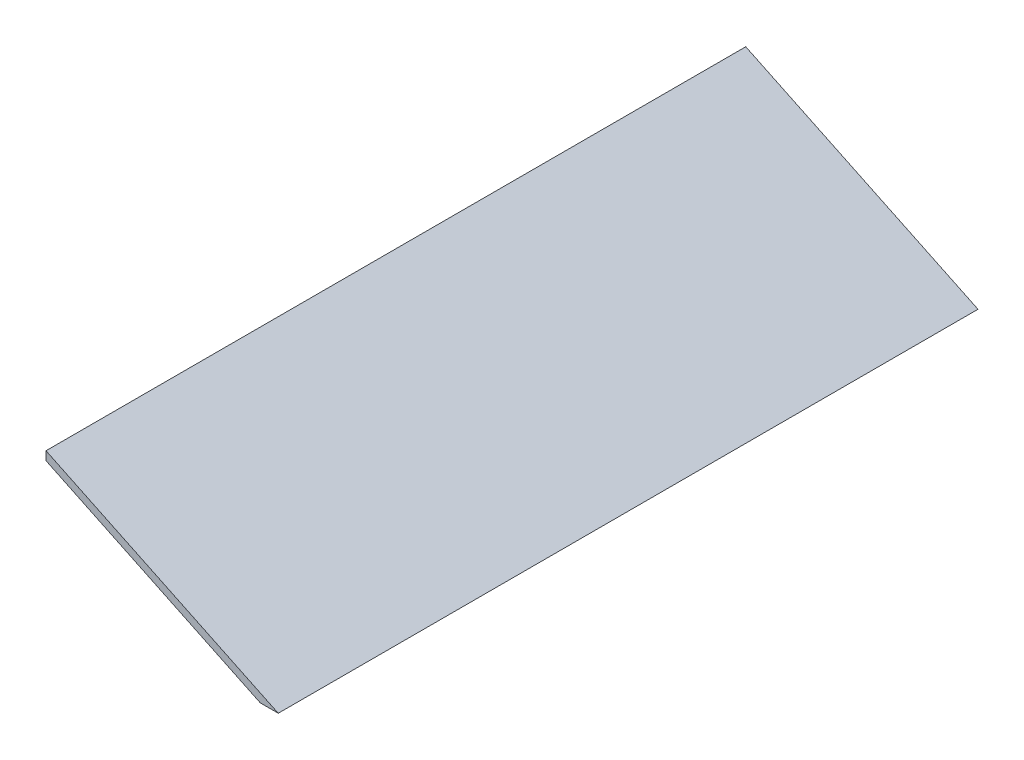
ISO-10303-21;
HEADER;
FILE_DESCRIPTION(('STEP AP214'),'2;1');
FILE_NAME('part.step','',(''),(''),'','','');
FILE_SCHEMA(('AUTOMOTIVE_DESIGN { 1 0 10303 214 1 1 1 1 }'));
ENDSEC;
DATA;
#1=APPLICATION_CONTEXT('core data for automotive mechanical design processes');
#2=APPLICATION_PROTOCOL_DEFINITION('international standard','automotive_design',2000,#1);
#3=PRODUCT_CONTEXT('',#1,'mechanical');
#4=PRODUCT('Part','Part','',(#3));
#5=PRODUCT_RELATED_PRODUCT_CATEGORY('part','',(#4));
#6=PRODUCT_DEFINITION_FORMATION('','',#4);
#7=PRODUCT_DEFINITION_CONTEXT('part definition',#1,'design');
#8=PRODUCT_DEFINITION('design','',#6,#7);
#9=PRODUCT_DEFINITION_SHAPE('','',#8);
#10=(LENGTH_UNIT() NAMED_UNIT(*) SI_UNIT(.MILLI.,.METRE.));
#11=(NAMED_UNIT(*) PLANE_ANGLE_UNIT() SI_UNIT($,.RADIAN.));
#12=(NAMED_UNIT(*) SI_UNIT($,.STERADIAN.) SOLID_ANGLE_UNIT());
#13=UNCERTAINTY_MEASURE_WITH_UNIT(LENGTH_MEASURE(1.E-05),#10,'distance_accuracy_value','');
#14=(GEOMETRIC_REPRESENTATION_CONTEXT(3) GLOBAL_UNCERTAINTY_ASSIGNED_CONTEXT((#13)) GLOBAL_UNIT_ASSIGNED_CONTEXT((#10,
#11,#12)) REPRESENTATION_CONTEXT('',''));
#15=CARTESIAN_POINT('',(0.,0.,0.));
#16=DIRECTION('',(0.,0.,1.));
#17=DIRECTION('',(1.,0.,0.));
#18=AXIS2_PLACEMENT_3D('',#15,#16,#17);
#19=CARTESIAN_POINT('',(-331.860776554524,76.5248789134339,450.));
#20=DIRECTION('',(-0.431904937574063,-0.901919134345837,0.));
#21=DIRECTION('',(0.901919134345838,-0.431904937574063,0.));
#22=AXIS2_PLACEMENT_3D('',#19,#20,#21);
#23=PLANE('',#22);
#24=DIRECTION('',(-0.901919134345837,0.431904937574063,0.));
#25=VECTOR('',#24,1.);
#26=CARTESIAN_POINT('',(-331.860776554524,76.5248789134339,0.));
#27=LINE('',#26,#25);
#28=CARTESIAN_POINT('',(-182.5,5.,0.));
#29=VERTEX_POINT('',#28);
#30=CARTESIAN_POINT('',(-331.860776554524,76.5248789134339,0.));
#31=VERTEX_POINT('',#30);
#32=EDGE_CURVE('E96',#29,#31,#27,.T.);
#33=ORIENTED_EDGE('',*,*,#32,.T.);
#34=DIRECTION('',(0.,0.,-1.));
#35=VECTOR('',#34,1.);
#36=CARTESIAN_POINT('',(-331.860776554524,76.5248789134339,450.));
#37=LINE('',#36,#35);
#38=CARTESIAN_POINT('',(-331.860776554524,76.5248789134339,450.));
#39=VERTEX_POINT('',#38);
#40=EDGE_CURVE('E11',#39,#31,#37,.T.);
#41=ORIENTED_EDGE('',*,*,#40,.F.);
#42=DIRECTION('',(-0.901919134345837,0.431904937574063,0.));
#43=VECTOR('',#42,1.);
#44=CARTESIAN_POINT('',(-331.860776554524,76.5248789134339,450.));
#45=LINE('',#44,#43);
#46=CARTESIAN_POINT('',(-182.5,5.,450.));
#47=VERTEX_POINT('',#46);
#48=EDGE_CURVE('E84',#47,#39,#45,.T.);
#49=ORIENTED_EDGE('',*,*,#48,.F.);
#50=DIRECTION('',(0.,0.,-1.));
#51=VECTOR('',#50,1.);
#52=CARTESIAN_POINT('',(-182.5,5.,450.));
#53=LINE('',#52,#51);
#54=EDGE_CURVE('E92',#47,#29,#53,.T.);
#55=ORIENTED_EDGE('',*,*,#54,.T.);
#56=EDGE_LOOP('',(#33,#41,#49,#55));
#57=FACE_BOUND('',#56,.T.);
#58=ADVANCED_FACE('F33',(#57),#23,.F.);
#59=CARTESIAN_POINT('',(-331.860776554524,76.5248789134339,450.));
#60=DIRECTION('',(1.,0.,0.));
#61=DIRECTION('',(0.,0.,-1.));
#62=AXIS2_PLACEMENT_3D('',#59,#60,#61);
#63=PLANE('',#62);
#64=DIRECTION('',(0.,-1.,0.));
#65=VECTOR('',#64,1.);
#66=CARTESIAN_POINT('',(-331.860776554524,76.5248789134339,0.));
#67=LINE('',#66,#65);
#68=CARTESIAN_POINT('',(-331.860776554524,70.9811446587809,0.));
#69=VERTEX_POINT('',#68);
#70=EDGE_CURVE('E88',#31,#69,#67,.T.);
#71=ORIENTED_EDGE('',*,*,#70,.T.);
#72=DIRECTION('',(0.,0.,-1.));
#73=VECTOR('',#72,1.);
#74=CARTESIAN_POINT('',(-331.860776554524,70.9811446587809,450.));
#75=LINE('',#74,#73);
#76=CARTESIAN_POINT('',(-331.860776554524,70.9811446587809,450.));
#77=VERTEX_POINT('',#76);
#78=EDGE_CURVE('E41',#77,#69,#75,.T.);
#79=ORIENTED_EDGE('',*,*,#78,.F.);
#80=DIRECTION('',(0.,-1.,0.));
#81=VECTOR('',#80,1.);
#82=CARTESIAN_POINT('',(-331.860776554524,76.5248789134339,450.));
#83=LINE('',#82,#81);
#84=EDGE_CURVE('E79',#39,#77,#83,.T.);
#85=ORIENTED_EDGE('',*,*,#84,.F.);
#86=ORIENTED_EDGE('',*,*,#40,.T.);
#87=EDGE_LOOP('',(#71,#79,#85,#86));
#88=FACE_BOUND('',#87,.T.);
#89=ADVANCED_FACE('F87',(#88),#63,.F.);
#90=CARTESIAN_POINT('',(-331.860776554524,70.9811446587809,450.));
#91=DIRECTION('',(0.431904937574063,0.901919134345837,0.));
#92=DIRECTION('',(-0.901919134345837,0.431904937574063,0.));
#93=AXIS2_PLACEMENT_3D('',#90,#91,#92);
#94=PLANE('',#93);
#95=DIRECTION('',(0.901919134345838,-0.431904937574063,0.));
#96=VECTOR('',#95,1.);
#97=CARTESIAN_POINT('',(-331.860776554524,70.9811446587809,0.));
#98=LINE('',#97,#96);
#99=CARTESIAN_POINT('',(-194.076621531775,5.,0.));
#100=VERTEX_POINT('',#99);
#101=EDGE_CURVE('E66',#69,#100,#98,.T.);
#102=ORIENTED_EDGE('',*,*,#101,.T.);
#103=DIRECTION('',(0.,0.,-1.));
#104=VECTOR('',#103,1.);
#105=CARTESIAN_POINT('',(-194.076621531775,5.,450.));
#106=LINE('',#105,#104);
#107=CARTESIAN_POINT('',(-194.076621531775,5.,450.));
#108=VERTEX_POINT('',#107);
#109=EDGE_CURVE('E89',#108,#100,#106,.T.);
#110=ORIENTED_EDGE('',*,*,#109,.F.);
#111=DIRECTION('',(0.901919134345838,-0.431904937574063,0.));
#112=VECTOR('',#111,1.);
#113=CARTESIAN_POINT('',(-331.860776554524,70.9811446587809,450.));
#114=LINE('',#113,#112);
#115=EDGE_CURVE('E82',#77,#108,#114,.T.);
#116=ORIENTED_EDGE('',*,*,#115,.F.);
#117=ORIENTED_EDGE('',*,*,#78,.T.);
#118=EDGE_LOOP('',(#102,#110,#116,#117));
#119=FACE_BOUND('',#118,.T.);
#120=ADVANCED_FACE('F90',(#119),#94,.F.);
#121=CARTESIAN_POINT('',(-182.5,5.,450.));
#122=DIRECTION('',(0.,1.,0.));
#123=DIRECTION('',(-1.,0.,0.));
#124=AXIS2_PLACEMENT_3D('',#121,#122,#123);
#125=PLANE('',#124);
#126=DIRECTION('',(1.,0.,0.));
#127=VECTOR('',#126,1.);
#128=CARTESIAN_POINT('',(-182.5,5.,0.));
#129=LINE('',#128,#127);
#130=EDGE_CURVE('E72',#100,#29,#129,.T.);
#131=ORIENTED_EDGE('',*,*,#130,.T.);
#132=ORIENTED_EDGE('',*,*,#54,.F.);
#133=DIRECTION('',(1.,0.,0.));
#134=VECTOR('',#133,1.);
#135=CARTESIAN_POINT('',(-182.5,5.,450.));
#136=LINE('',#135,#134);
#137=EDGE_CURVE('E49',#108,#47,#136,.T.);
#138=ORIENTED_EDGE('',*,*,#137,.F.);
#139=ORIENTED_EDGE('',*,*,#109,.T.);
#140=EDGE_LOOP('',(#131,#132,#138,#139));
#141=FACE_BOUND('',#140,.T.);
#142=ADVANCED_FACE('F103',(#141),#125,.F.);
#143=CARTESIAN_POINT('',(0.,0.,450.));
#144=DIRECTION('',(0.,0.,-1.));
#145=DIRECTION('',(-1.,0.,0.));
#146=AXIS2_PLACEMENT_3D('',#143,#144,#145);
#147=PLANE('',#146);
#148=ORIENTED_EDGE('',*,*,#48,.T.);
#149=ORIENTED_EDGE('',*,*,#84,.T.);
#150=ORIENTED_EDGE('',*,*,#115,.T.);
#151=ORIENTED_EDGE('',*,*,#137,.T.);
#152=EDGE_LOOP('',(#148,#149,#150,#151));
#153=FACE_BOUND('',#152,.T.);
#154=ADVANCED_FACE('F80',(#153),#147,.F.);
#155=CARTESIAN_POINT('',(0.,0.,0.));
#156=DIRECTION('',(0.,0.,-1.));
#157=DIRECTION('',(-1.,0.,0.));
#158=AXIS2_PLACEMENT_3D('',#155,#156,#157);
#159=PLANE('',#158);
#160=ORIENTED_EDGE('',*,*,#32,.F.);
#161=ORIENTED_EDGE('',*,*,#130,.F.);
#162=ORIENTED_EDGE('',*,*,#101,.F.);
#163=ORIENTED_EDGE('',*,*,#70,.F.);
#164=EDGE_LOOP('',(#160,#161,#162,#163));
#165=FACE_BOUND('',#164,.T.);
#166=ADVANCED_FACE('F106',(#165),#159,.T.);
#167=CLOSED_SHELL('',(#58,#89,#120,#142,#154,#166));
#168=MANIFOLD_SOLID_BREP('B2',#167);
#169=ADVANCED_BREP_SHAPE_REPRESENTATION('',(#18,#168),#14);
#170=SHAPE_DEFINITION_REPRESENTATION(#9,#169);
ENDSEC;
END-ISO-10303-21;
